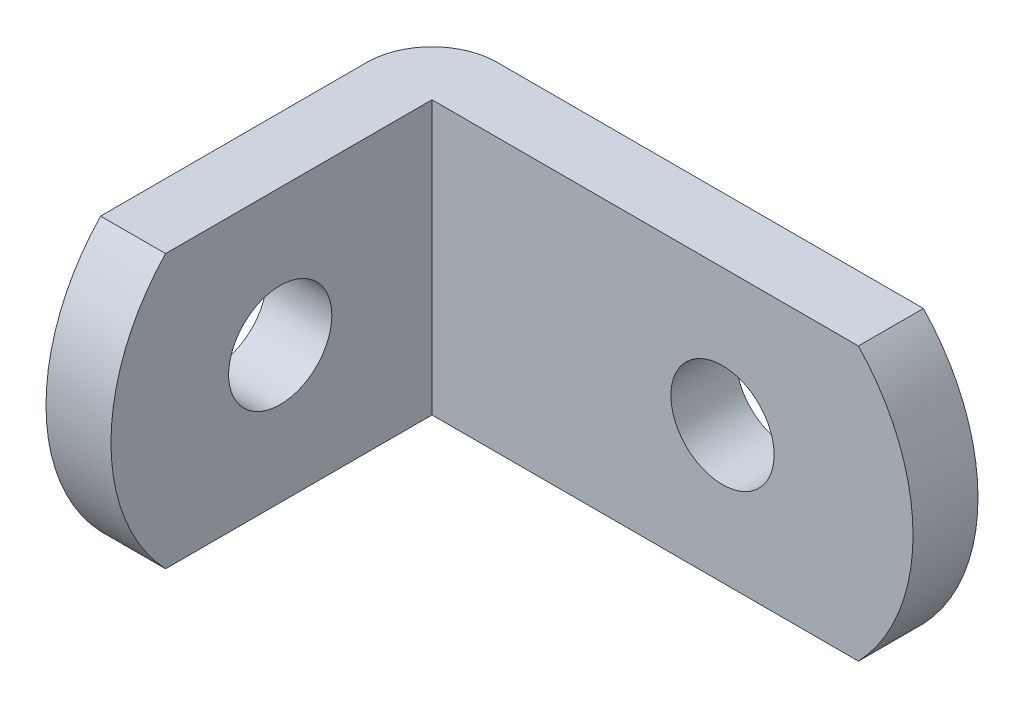
ISO-10303-21;
HEADER;
FILE_DESCRIPTION(('STEP AP214'),'2;1');
FILE_NAME('part.step','',(''),(''),'','','');
FILE_SCHEMA(('AUTOMOTIVE_DESIGN { 1 0 10303 214 1 1 1 1 }'));
ENDSEC;
DATA;
#1=APPLICATION_CONTEXT('core data for automotive mechanical design processes');
#2=APPLICATION_PROTOCOL_DEFINITION('international standard','automotive_design',2000,#1);
#3=PRODUCT_CONTEXT('',#1,'mechanical');
#4=PRODUCT('Part','Part','',(#3));
#5=PRODUCT_RELATED_PRODUCT_CATEGORY('part','',(#4));
#6=PRODUCT_DEFINITION_FORMATION('','',#4);
#7=PRODUCT_DEFINITION_CONTEXT('part definition',#1,'design');
#8=PRODUCT_DEFINITION('design','',#6,#7);
#9=PRODUCT_DEFINITION_SHAPE('','',#8);
#10=(LENGTH_UNIT() NAMED_UNIT(*) SI_UNIT(.MILLI.,.METRE.));
#11=(NAMED_UNIT(*) PLANE_ANGLE_UNIT() SI_UNIT($,.RADIAN.));
#12=(NAMED_UNIT(*) SI_UNIT($,.STERADIAN.) SOLID_ANGLE_UNIT());
#13=UNCERTAINTY_MEASURE_WITH_UNIT(LENGTH_MEASURE(1.E-05),#10,'distance_accuracy_value','');
#14=(GEOMETRIC_REPRESENTATION_CONTEXT(3) GLOBAL_UNCERTAINTY_ASSIGNED_CONTEXT((#13)) GLOBAL_UNIT_ASSIGNED_CONTEXT((#10,
#11,#12)) REPRESENTATION_CONTEXT('',''));
#15=CARTESIAN_POINT('',(0.,0.,0.));
#16=DIRECTION('',(0.,0.,1.));
#17=DIRECTION('',(1.,0.,0.));
#18=AXIS2_PLACEMENT_3D('',#15,#16,#17);
#19=CARTESIAN_POINT('',(72.9938399678853,0.,8.75030000000001));
#20=DIRECTION('',(-1.,0.,0.));
#21=DIRECTION('',(0.,0.,1.));
#22=AXIS2_PLACEMENT_3D('',#19,#20,#21);
#23=CYLINDRICAL_SURFACE('',#22,9.20749999999999);
#24=DIRECTION('',(-1.,0.,0.));
#25=VECTOR('',#24,1.);
#26=CARTESIAN_POINT('',(72.9938399678853,-6.35,15.4178));
#27=LINE('',#26,#25);
#28=CARTESIAN_POINT('',(0.,-6.35,15.4178));
#29=VERTEX_POINT('',#28);
#30=CARTESIAN_POINT('',(3.0226,-6.34999999999999,15.4178));
#31=VERTEX_POINT('',#30);
#32=EDGE_CURVE('E40',#29,#31,#27,.F.);
#33=ORIENTED_EDGE('',*,*,#32,.T.);
#34=CARTESIAN_POINT('',(3.0226,0.,8.75030000000001));
#35=DIRECTION('',(-1.,0.,0.));
#36=DIRECTION('',(0.,0.,1.));
#37=AXIS2_PLACEMENT_3D('',#34,#35,#36);
#38=CIRCLE('',#37,9.20749999999999);
#39=CARTESIAN_POINT('',(3.0226,6.35,15.4178));
#40=VERTEX_POINT('',#39);
#41=EDGE_CURVE('E121',#40,#31,#38,.F.);
#42=ORIENTED_EDGE('',*,*,#41,.F.);
#43=DIRECTION('',(-1.,0.,0.));
#44=VECTOR('',#43,1.);
#45=CARTESIAN_POINT('',(72.9938399678853,6.35,15.4178));
#46=LINE('',#45,#44);
#47=CARTESIAN_POINT('',(0.,6.35,15.4178));
#48=VERTEX_POINT('',#47);
#49=EDGE_CURVE('E117',#40,#48,#46,.T.);
#50=ORIENTED_EDGE('',*,*,#49,.T.);
#51=CARTESIAN_POINT('',(0.,0.,8.75030000000001));
#52=DIRECTION('',(-1.,0.,0.));
#53=DIRECTION('',(0.,0.,1.));
#54=AXIS2_PLACEMENT_3D('',#51,#52,#53);
#55=CIRCLE('',#54,9.20749999999999);
#56=EDGE_CURVE('E123',#48,#29,#55,.F.);
#57=ORIENTED_EDGE('',*,*,#56,.T.);
#58=EDGE_LOOP('',(#33,#42,#50,#57));
#59=FACE_BOUND('',#58,.T.);
#60=ADVANCED_FACE('F32',(#59),#23,.T.);
#61=CARTESIAN_POINT('',(3.0226,6.35,3.0226));
#62=DIRECTION('',(0.,0.,-1.));
#63=DIRECTION('',(-1.,0.,0.));
#64=AXIS2_PLACEMENT_3D('',#61,#62,#63);
#65=PLANE('',#64);
#66=CARTESIAN_POINT('',(16.5354,0.,3.0226));
#67=DIRECTION('',(0.,0.,1.));
#68=DIRECTION('',(1.,0.,0.));
#69=AXIS2_PLACEMENT_3D('',#66,#67,#68);
#70=CIRCLE('',#69,2.4);
#71=CARTESIAN_POINT('',(18.9354,0.,3.0226));
#72=VERTEX_POINT('',#71);
#73=EDGE_CURVE('E165',#72,#72,#70,.T.);
#74=ORIENTED_EDGE('',*,*,#73,.F.);
#75=EDGE_LOOP('',(#74));
#76=FACE_BOUND('',#75,.T.);
#77=DIRECTION('',(1.,0.,0.));
#78=VECTOR('',#77,1.);
#79=CARTESIAN_POINT('',(3.0226,-6.35,3.0226));
#80=LINE('',#79,#78);
#81=CARTESIAN_POINT('',(3.0226,-6.35,3.0226));
#82=VERTEX_POINT('',#81);
#83=CARTESIAN_POINT('',(22.86,-6.35,3.0226));
#84=VERTEX_POINT('',#83);
#85=EDGE_CURVE('E100',#82,#84,#80,.T.);
#86=ORIENTED_EDGE('',*,*,#85,.T.);
#87=CARTESIAN_POINT('',(16.1925,0.,3.0226));
#88=DIRECTION('',(0.,0.,-1.));
#89=DIRECTION('',(-1.,0.,0.));
#90=AXIS2_PLACEMENT_3D('',#87,#88,#89);
#91=CIRCLE('',#90,9.20749999999998);
#92=CARTESIAN_POINT('',(22.86,6.35,3.0226));
#93=VERTEX_POINT('',#92);
#94=EDGE_CURVE('E54',#84,#93,#91,.F.);
#95=ORIENTED_EDGE('',*,*,#94,.T.);
#96=DIRECTION('',(1.,0.,0.));
#97=VECTOR('',#96,1.);
#98=CARTESIAN_POINT('',(3.0226,6.35,3.0226));
#99=LINE('',#98,#97);
#100=CARTESIAN_POINT('',(3.0226,6.35,3.0226));
#101=VERTEX_POINT('',#100);
#102=EDGE_CURVE('E126',#101,#93,#99,.T.);
#103=ORIENTED_EDGE('',*,*,#102,.F.);
#104=DIRECTION('',(0.,-1.,0.));
#105=VECTOR('',#104,1.);
#106=CARTESIAN_POINT('',(3.0226,6.35,3.0226));
#107=LINE('',#106,#105);
#108=EDGE_CURVE('E137',#101,#82,#107,.T.);
#109=ORIENTED_EDGE('',*,*,#108,.T.);
#110=EDGE_LOOP('',(#86,#95,#103,#109));
#111=FACE_BOUND('',#110,.T.);
#112=ADVANCED_FACE('F34',(#76,#111),#65,.F.);
#113=CARTESIAN_POINT('',(3.0226,6.35,0.));
#114=DIRECTION('',(0.,0.,-1.));
#115=DIRECTION('',(-1.,0.,0.));
#116=AXIS2_PLACEMENT_3D('',#113,#114,#115);
#117=PLANE('',#116);
#118=CARTESIAN_POINT('',(16.5354,0.,0.));
#119=DIRECTION('',(0.,0.,1.));
#120=DIRECTION('',(1.,0.,0.));
#121=AXIS2_PLACEMENT_3D('',#118,#119,#120);
#122=CIRCLE('',#121,2.4);
#123=CARTESIAN_POINT('',(18.9354,0.,0.));
#124=VERTEX_POINT('',#123);
#125=EDGE_CURVE('E163',#124,#124,#122,.T.);
#126=ORIENTED_EDGE('',*,*,#125,.T.);
#127=EDGE_LOOP('',(#126));
#128=FACE_BOUND('',#127,.T.);
#129=CARTESIAN_POINT('',(16.1925,0.,0.));
#130=DIRECTION('',(0.,0.,-1.));
#131=DIRECTION('',(-1.,0.,0.));
#132=AXIS2_PLACEMENT_3D('',#129,#130,#131);
#133=CIRCLE('',#132,9.20749999999998);
#134=CARTESIAN_POINT('',(22.86,-6.35,0.));
#135=VERTEX_POINT('',#134);
#136=CARTESIAN_POINT('',(22.86,6.35,0.));
#137=VERTEX_POINT('',#136);
#138=EDGE_CURVE('E46',#135,#137,#133,.F.);
#139=ORIENTED_EDGE('',*,*,#138,.F.);
#140=DIRECTION('',(1.,0.,0.));
#141=VECTOR('',#140,1.);
#142=CARTESIAN_POINT('',(3.0226,-6.35,0.));
#143=LINE('',#142,#141);
#144=CARTESIAN_POINT('',(3.0226,-6.35,0.));
#145=VERTEX_POINT('',#144);
#146=EDGE_CURVE('E94',#145,#135,#143,.T.);
#147=ORIENTED_EDGE('',*,*,#146,.F.);
#148=DIRECTION('',(0.,-1.,0.));
#149=VECTOR('',#148,1.);
#150=CARTESIAN_POINT('',(3.0226,6.35,0.));
#151=LINE('',#150,#149);
#152=CARTESIAN_POINT('',(3.0226,6.35,0.));
#153=VERTEX_POINT('',#152);
#154=EDGE_CURVE('E148',#153,#145,#151,.T.);
#155=ORIENTED_EDGE('',*,*,#154,.F.);
#156=DIRECTION('',(1.,0.,0.));
#157=VECTOR('',#156,1.);
#158=CARTESIAN_POINT('',(3.0226,6.35,0.));
#159=LINE('',#158,#157);
#160=EDGE_CURVE('E105',#153,#137,#159,.T.);
#161=ORIENTED_EDGE('',*,*,#160,.T.);
#162=EDGE_LOOP('',(#139,#147,#155,#161));
#163=FACE_BOUND('',#162,.T.);
#164=ADVANCED_FACE('F103',(#128,#163),#117,.T.);
#165=CARTESIAN_POINT('',(3.0226,6.35,3.0226));
#166=DIRECTION('',(0.,-1.,0.));
#167=DIRECTION('',(0.,0.,-1.));
#168=AXIS2_PLACEMENT_3D('',#165,#166,#167);
#169=CYLINDRICAL_SURFACE('',#168,3.0226);
#170=CARTESIAN_POINT('',(3.0226,-6.35,3.0226));
#171=DIRECTION('',(0.,-1.,0.));
#172=DIRECTION('',(0.,0.,1.));
#173=AXIS2_PLACEMENT_3D('',#170,#171,#172);
#174=CIRCLE('',#173,3.0226);
#175=CARTESIAN_POINT('',(0.,-6.35,3.0226));
#176=VERTEX_POINT('',#175);
#177=EDGE_CURVE('E98',#176,#145,#174,.T.);
#178=ORIENTED_EDGE('',*,*,#177,.F.);
#179=DIRECTION('',(0.,-1.,0.));
#180=VECTOR('',#179,1.);
#181=CARTESIAN_POINT('',(0.,6.35,3.0226));
#182=LINE('',#181,#180);
#183=CARTESIAN_POINT('',(0.,6.35,3.0226));
#184=VERTEX_POINT('',#183);
#185=EDGE_CURVE('E145',#184,#176,#182,.T.);
#186=ORIENTED_EDGE('',*,*,#185,.F.);
#187=CARTESIAN_POINT('',(3.0226,6.35,3.0226));
#188=DIRECTION('',(0.,-1.,0.));
#189=DIRECTION('',(0.,0.,1.));
#190=AXIS2_PLACEMENT_3D('',#187,#188,#189);
#191=CIRCLE('',#190,3.0226);
#192=EDGE_CURVE('E130',#184,#153,#191,.T.);
#193=ORIENTED_EDGE('',*,*,#192,.T.);
#194=ORIENTED_EDGE('',*,*,#154,.T.);
#195=EDGE_LOOP('',(#178,#186,#193,#194));
#196=FACE_BOUND('',#195,.T.);
#197=ADVANCED_FACE('F160',(#196),#169,.T.);
#198=CARTESIAN_POINT('',(0.,6.35,3.0226));
#199=DIRECTION('',(-1.,0.,0.));
#200=DIRECTION('',(0.,0.,1.));
#201=AXIS2_PLACEMENT_3D('',#198,#199,#200);
#202=PLANE('',#201);
#203=CARTESIAN_POINT('',(0.,0.,10.0838));
#204=DIRECTION('',(1.,0.,0.));
#205=DIRECTION('',(0.,0.,-1.));
#206=AXIS2_PLACEMENT_3D('',#203,#204,#205);
#207=CIRCLE('',#206,2.4);
#208=CARTESIAN_POINT('',(0.,0.,7.6838));
#209=VERTEX_POINT('',#208);
#210=EDGE_CURVE('E112',#209,#209,#207,.T.);
#211=ORIENTED_EDGE('',*,*,#210,.T.);
#212=EDGE_LOOP('',(#211));
#213=FACE_BOUND('',#212,.T.);
#214=ORIENTED_EDGE('',*,*,#56,.F.);
#215=DIRECTION('',(0.,0.,-1.));
#216=VECTOR('',#215,1.);
#217=CARTESIAN_POINT('',(0.,6.35,3.0226));
#218=LINE('',#217,#216);
#219=EDGE_CURVE('E133',#48,#184,#218,.T.);
#220=ORIENTED_EDGE('',*,*,#219,.T.);
#221=ORIENTED_EDGE('',*,*,#185,.T.);
#222=DIRECTION('',(0.,0.,-1.));
#223=VECTOR('',#222,1.);
#224=CARTESIAN_POINT('',(0.,-6.35,3.0226));
#225=LINE('',#224,#223);
#226=EDGE_CURVE('E140',#29,#176,#225,.T.);
#227=ORIENTED_EDGE('',*,*,#226,.F.);
#228=EDGE_LOOP('',(#214,#220,#221,#227));
#229=FACE_BOUND('',#228,.T.);
#230=ADVANCED_FACE('F155',(#213,#229),#202,.T.);
#231=CARTESIAN_POINT('',(3.0226,6.35,3.0226));
#232=DIRECTION('',(-1.,0.,0.));
#233=DIRECTION('',(0.,0.,1.));
#234=AXIS2_PLACEMENT_3D('',#231,#232,#233);
#235=PLANE('',#234);
#236=CARTESIAN_POINT('',(3.0226,0.,10.0838));
#237=DIRECTION('',(1.,0.,0.));
#238=DIRECTION('',(0.,0.,-1.));
#239=AXIS2_PLACEMENT_3D('',#236,#237,#238);
#240=CIRCLE('',#239,2.4);
#241=CARTESIAN_POINT('',(3.0226,0.,7.6838));
#242=VERTEX_POINT('',#241);
#243=EDGE_CURVE('E109',#242,#242,#240,.T.);
#244=ORIENTED_EDGE('',*,*,#243,.F.);
#245=EDGE_LOOP('',(#244));
#246=FACE_BOUND('',#245,.T.);
#247=ORIENTED_EDGE('',*,*,#41,.T.);
#248=DIRECTION('',(0.,0.,-1.));
#249=VECTOR('',#248,1.);
#250=CARTESIAN_POINT('',(3.0226,-6.35,3.0226));
#251=LINE('',#250,#249);
#252=EDGE_CURVE('E128',#31,#82,#251,.T.);
#253=ORIENTED_EDGE('',*,*,#252,.T.);
#254=ORIENTED_EDGE('',*,*,#108,.F.);
#255=DIRECTION('',(0.,0.,-1.));
#256=VECTOR('',#255,1.);
#257=CARTESIAN_POINT('',(3.0226,6.35,3.0226));
#258=LINE('',#257,#256);
#259=EDGE_CURVE('E135',#40,#101,#258,.T.);
#260=ORIENTED_EDGE('',*,*,#259,.F.);
#261=EDGE_LOOP('',(#247,#253,#254,#260));
#262=FACE_BOUND('',#261,.T.);
#263=ADVANCED_FACE('F177',(#246,#262),#235,.F.);
#264=CARTESIAN_POINT('',(3.0226,6.35,3.0226));
#265=DIRECTION('',(0.,-1.,0.));
#266=DIRECTION('',(-1.,0.,0.));
#267=AXIS2_PLACEMENT_3D('',#264,#265,#266);
#268=PLANE('',#267);
#269=ORIENTED_EDGE('',*,*,#102,.T.);
#270=DIRECTION('',(0.,0.,-1.));
#271=VECTOR('',#270,1.);
#272=CARTESIAN_POINT('',(22.86,6.35,60.5160899678853));
#273=LINE('',#272,#271);
#274=EDGE_CURVE('E106',#93,#137,#273,.T.);
#275=ORIENTED_EDGE('',*,*,#274,.T.);
#276=ORIENTED_EDGE('',*,*,#160,.F.);
#277=ORIENTED_EDGE('',*,*,#192,.F.);
#278=ORIENTED_EDGE('',*,*,#219,.F.);
#279=ORIENTED_EDGE('',*,*,#49,.F.);
#280=ORIENTED_EDGE('',*,*,#259,.T.);
#281=EDGE_LOOP('',(#269,#275,#276,#277,#278,#279,#280));
#282=FACE_BOUND('',#281,.T.);
#283=ADVANCED_FACE('F162',(#282),#268,.F.);
#284=CARTESIAN_POINT('',(3.0226,-6.35,3.0226));
#285=DIRECTION('',(0.,-1.,0.));
#286=DIRECTION('',(-1.,0.,0.));
#287=AXIS2_PLACEMENT_3D('',#284,#285,#286);
#288=PLANE('',#287);
#289=DIRECTION('',(0.,0.,-1.));
#290=VECTOR('',#289,1.);
#291=CARTESIAN_POINT('',(22.86,-6.35,60.5160899678853));
#292=LINE('',#291,#290);
#293=EDGE_CURVE('E11',#84,#135,#292,.T.);
#294=ORIENTED_EDGE('',*,*,#293,.F.);
#295=ORIENTED_EDGE('',*,*,#85,.F.);
#296=ORIENTED_EDGE('',*,*,#252,.F.);
#297=ORIENTED_EDGE('',*,*,#32,.F.);
#298=ORIENTED_EDGE('',*,*,#226,.T.);
#299=ORIENTED_EDGE('',*,*,#177,.T.);
#300=ORIENTED_EDGE('',*,*,#146,.T.);
#301=EDGE_LOOP('',(#294,#295,#296,#297,#298,#299,#300));
#302=FACE_BOUND('',#301,.T.);
#303=ADVANCED_FACE('F95',(#302),#288,.T.);
#304=CARTESIAN_POINT('',(0.,0.,10.0838));
#305=DIRECTION('',(1.,0.,0.));
#306=DIRECTION('',(0.,0.,-1.));
#307=AXIS2_PLACEMENT_3D('',#304,#305,#306);
#308=CYLINDRICAL_SURFACE('',#307,2.4);
#309=ORIENTED_EDGE('',*,*,#210,.F.);
#310=EDGE_LOOP('',(#309));
#311=FACE_BOUND('',#310,.T.);
#312=ORIENTED_EDGE('',*,*,#243,.T.);
#313=EDGE_LOOP('',(#312));
#314=FACE_BOUND('',#313,.T.);
#315=ADVANCED_FACE('F195',(#311,#314),#308,.F.);
#316=CARTESIAN_POINT('',(16.1925,0.,60.5160899678853));
#317=DIRECTION('',(0.,0.,-1.));
#318=DIRECTION('',(-1.,0.,0.));
#319=AXIS2_PLACEMENT_3D('',#316,#317,#318);
#320=CYLINDRICAL_SURFACE('',#319,9.20749999999998);
#321=ORIENTED_EDGE('',*,*,#94,.F.);
#322=ORIENTED_EDGE('',*,*,#293,.T.);
#323=ORIENTED_EDGE('',*,*,#138,.T.);
#324=ORIENTED_EDGE('',*,*,#274,.F.);
#325=EDGE_LOOP('',(#321,#322,#323,#324));
#326=FACE_BOUND('',#325,.T.);
#327=ADVANCED_FACE('F108',(#326),#320,.T.);
#328=CARTESIAN_POINT('',(16.5354,0.,0.));
#329=DIRECTION('',(0.,0.,1.));
#330=DIRECTION('',(1.,0.,0.));
#331=AXIS2_PLACEMENT_3D('',#328,#329,#330);
#332=CYLINDRICAL_SURFACE('',#331,2.4);
#333=ORIENTED_EDGE('',*,*,#125,.F.);
#334=EDGE_LOOP('',(#333));
#335=FACE_BOUND('',#334,.T.);
#336=ORIENTED_EDGE('',*,*,#73,.T.);
#337=EDGE_LOOP('',(#336));
#338=FACE_BOUND('',#337,.T.);
#339=ADVANCED_FACE('F171',(#335,#338),#332,.F.);
#340=CLOSED_SHELL('',(#60,#112,#164,#197,#230,#263,#283,#303,#315,#327,#339));
#341=MANIFOLD_SOLID_BREP('B2',#340);
#342=ADVANCED_BREP_SHAPE_REPRESENTATION('',(#18,#341),#14);
#343=SHAPE_DEFINITION_REPRESENTATION(#9,#342);
ENDSEC;
END-ISO-10303-21;
